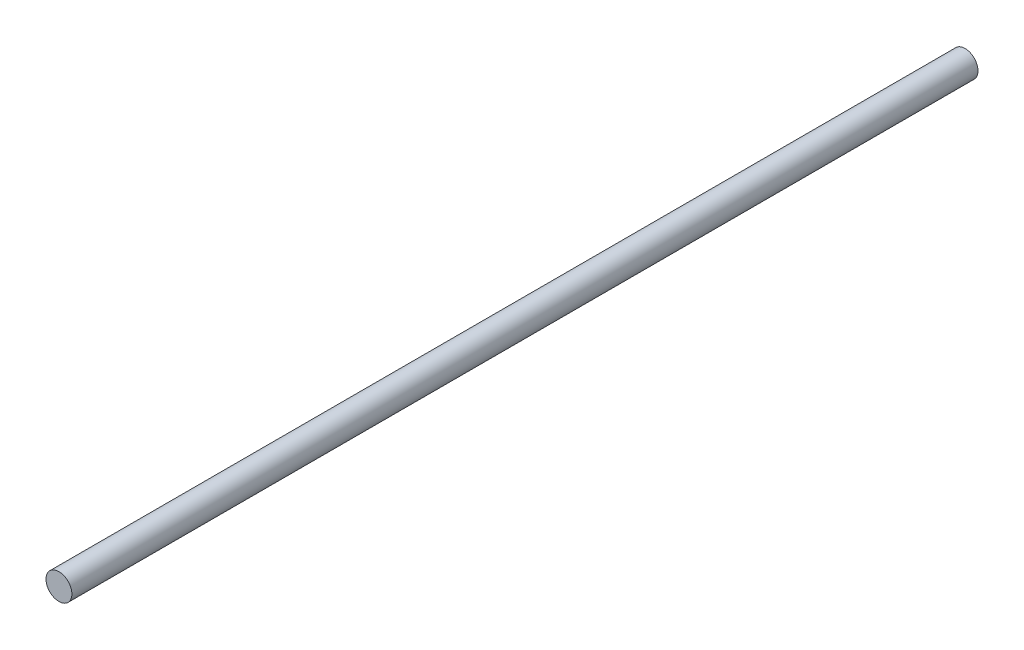
ISO-10303-21;
HEADER;
FILE_DESCRIPTION(('STEP AP214'),'2;1');
FILE_NAME('part.step','',(''),(''),'','','');
FILE_SCHEMA(('AUTOMOTIVE_DESIGN { 1 0 10303 214 1 1 1 1 }'));
ENDSEC;
DATA;
#1=APPLICATION_CONTEXT('core data for automotive mechanical design processes');
#2=APPLICATION_PROTOCOL_DEFINITION('international standard','automotive_design',2000,#1);
#3=PRODUCT_CONTEXT('',#1,'mechanical');
#4=PRODUCT('Part','Part','',(#3));
#5=PRODUCT_RELATED_PRODUCT_CATEGORY('part','',(#4));
#6=PRODUCT_DEFINITION_FORMATION('','',#4);
#7=PRODUCT_DEFINITION_CONTEXT('part definition',#1,'design');
#8=PRODUCT_DEFINITION('design','',#6,#7);
#9=PRODUCT_DEFINITION_SHAPE('','',#8);
#10=(LENGTH_UNIT() NAMED_UNIT(*) SI_UNIT(.MILLI.,.METRE.));
#11=(NAMED_UNIT(*) PLANE_ANGLE_UNIT() SI_UNIT($,.RADIAN.));
#12=(NAMED_UNIT(*) SI_UNIT($,.STERADIAN.) SOLID_ANGLE_UNIT());
#13=UNCERTAINTY_MEASURE_WITH_UNIT(LENGTH_MEASURE(1.E-05),#10,'distance_accuracy_value','');
#14=(GEOMETRIC_REPRESENTATION_CONTEXT(3) GLOBAL_UNCERTAINTY_ASSIGNED_CONTEXT((#13)) GLOBAL_UNIT_ASSIGNED_CONTEXT((#10,
#11,#12)) REPRESENTATION_CONTEXT('',''));
#15=CARTESIAN_POINT('',(0.,0.,0.));
#16=DIRECTION('',(0.,0.,1.));
#17=DIRECTION('',(1.,0.,0.));
#18=AXIS2_PLACEMENT_3D('',#15,#16,#17);
#19=CARTESIAN_POINT('',(0.,0.,105.));
#20=DIRECTION('',(0.,0.,-1.));
#21=DIRECTION('',(-1.,0.,0.));
#22=AXIS2_PLACEMENT_3D('',#19,#20,#21);
#23=CYLINDRICAL_SURFACE('',#22,1.5);
#24=CARTESIAN_POINT('',(0.,0.,105.));
#25=DIRECTION('',(0.,0.,1.));
#26=DIRECTION('',(1.,0.,0.));
#27=AXIS2_PLACEMENT_3D('',#24,#25,#26);
#28=CIRCLE('',#27,1.5);
#29=CARTESIAN_POINT('',(1.5,0.,105.));
#30=VERTEX_POINT('',#29);
#31=EDGE_CURVE('E10',#30,#30,#28,.T.);
#32=ORIENTED_EDGE('',*,*,#31,.F.);
#33=EDGE_LOOP('',(#32));
#34=FACE_BOUND('',#33,.T.);
#35=CARTESIAN_POINT('',(0.,0.,0.));
#36=DIRECTION('',(0.,0.,1.));
#37=DIRECTION('',(1.,0.,0.));
#38=AXIS2_PLACEMENT_3D('',#35,#36,#37);
#39=CIRCLE('',#38,1.5);
#40=CARTESIAN_POINT('',(1.5,0.,0.));
#41=VERTEX_POINT('',#40);
#42=EDGE_CURVE('E31',#41,#41,#39,.T.);
#43=ORIENTED_EDGE('',*,*,#42,.T.);
#44=EDGE_LOOP('',(#43));
#45=FACE_BOUND('',#44,.T.);
#46=ADVANCED_FACE('F28',(#34,#45),#23,.T.);
#47=CARTESIAN_POINT('',(0.,0.,105.));
#48=DIRECTION('',(0.,0.,1.));
#49=DIRECTION('',(1.,0.,0.));
#50=AXIS2_PLACEMENT_3D('',#47,#48,#49);
#51=PLANE('',#50);
#52=ORIENTED_EDGE('',*,*,#31,.T.);
#53=EDGE_LOOP('',(#52));
#54=FACE_BOUND('',#53,.T.);
#55=ADVANCED_FACE('F43',(#54),#51,.T.);
#56=CARTESIAN_POINT('',(0.,0.,0.));
#57=DIRECTION('',(0.,0.,1.));
#58=DIRECTION('',(1.,0.,0.));
#59=AXIS2_PLACEMENT_3D('',#56,#57,#58);
#60=PLANE('',#59);
#61=ORIENTED_EDGE('',*,*,#42,.F.);
#62=EDGE_LOOP('',(#61));
#63=FACE_BOUND('',#62,.T.);
#64=ADVANCED_FACE('F41',(#63),#60,.F.);
#65=CLOSED_SHELL('',(#46,#55,#64));
#66=MANIFOLD_SOLID_BREP('B2',#65);
#67=ADVANCED_BREP_SHAPE_REPRESENTATION('',(#18,#66),#14);
#68=SHAPE_DEFINITION_REPRESENTATION(#9,#67);
ENDSEC;
END-ISO-10303-21;
